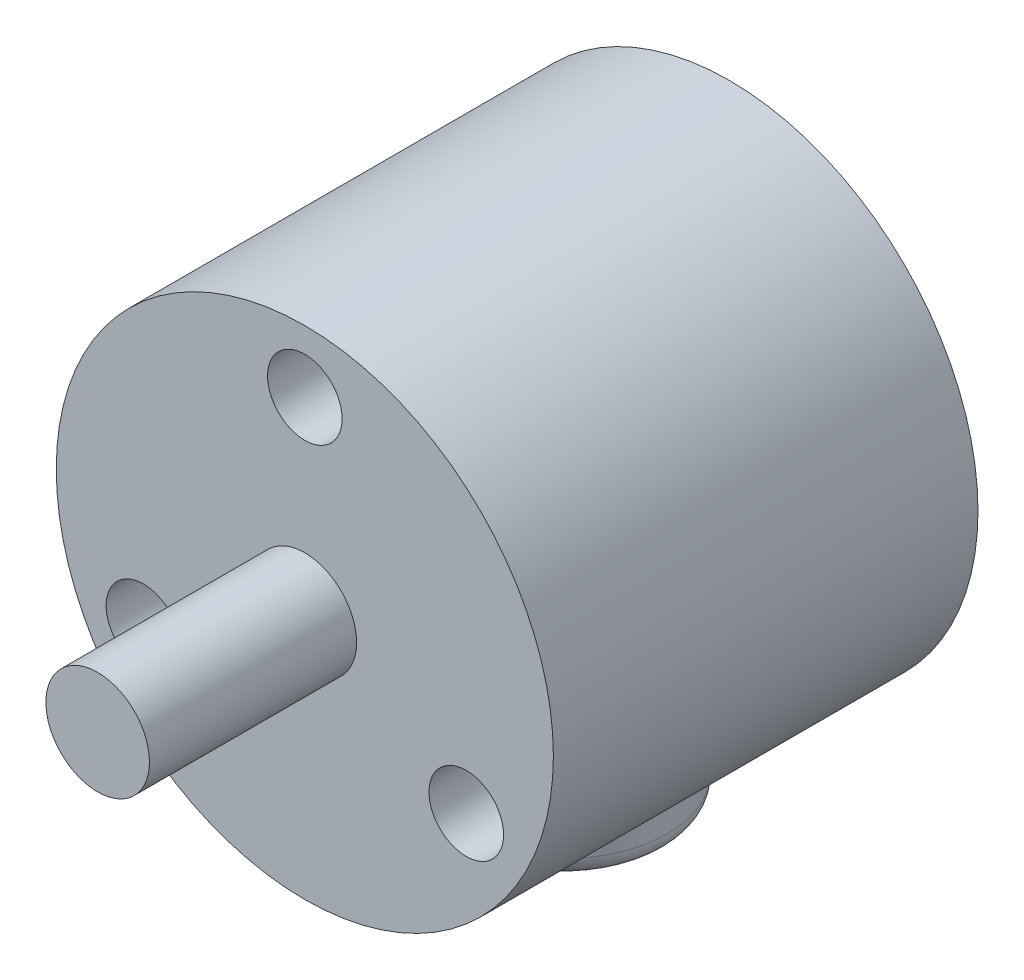
ISO-10303-21;
HEADER;
FILE_DESCRIPTION(('STEP AP214'),'2;1');
FILE_NAME('part.step','',(''),(''),'','','');
FILE_SCHEMA(('AUTOMOTIVE_DESIGN { 1 0 10303 214 1 1 1 1 }'));
ENDSEC;
DATA;
#1=APPLICATION_CONTEXT('core data for automotive mechanical design processes');
#2=APPLICATION_PROTOCOL_DEFINITION('international standard','automotive_design',2000,#1);
#3=PRODUCT_CONTEXT('',#1,'mechanical');
#4=PRODUCT('Part','Part','',(#3));
#5=PRODUCT_RELATED_PRODUCT_CATEGORY('part','',(#4));
#6=PRODUCT_DEFINITION_FORMATION('','',#4);
#7=PRODUCT_DEFINITION_CONTEXT('part definition',#1,'design');
#8=PRODUCT_DEFINITION('design','',#6,#7);
#9=PRODUCT_DEFINITION_SHAPE('','',#8);
#10=(LENGTH_UNIT() NAMED_UNIT(*) SI_UNIT(.MILLI.,.METRE.));
#11=(NAMED_UNIT(*) PLANE_ANGLE_UNIT() SI_UNIT($,.RADIAN.));
#12=(NAMED_UNIT(*) SI_UNIT($,.STERADIAN.) SOLID_ANGLE_UNIT());
#13=UNCERTAINTY_MEASURE_WITH_UNIT(LENGTH_MEASURE(1.E-05),#10,'distance_accuracy_value','');
#14=(GEOMETRIC_REPRESENTATION_CONTEXT(3) GLOBAL_UNCERTAINTY_ASSIGNED_CONTEXT((#13)) GLOBAL_UNIT_ASSIGNED_CONTEXT((#10,
#11,#12)) REPRESENTATION_CONTEXT('',''));
#15=CARTESIAN_POINT('',(0.,0.,0.));
#16=DIRECTION('',(0.,0.,1.));
#17=DIRECTION('',(1.,0.,0.));
#18=AXIS2_PLACEMENT_3D('',#15,#16,#17);
#19=CARTESIAN_POINT('',(0.,0.,20.5));
#20=DIRECTION('',(0.,0.,-1.));
#21=DIRECTION('',(-1.,0.,0.));
#22=AXIS2_PLACEMENT_3D('',#19,#20,#21);
#23=CYLINDRICAL_SURFACE('',#22,12.);
#24=CARTESIAN_POINT('',(0.,-12.,13.));
#25=CARTESIAN_POINT('',(0.133971202199808,-11.9999992729584,12.9999990914666));
#26=CARTESIAN_POINT('',(0.267987722487516,-11.9977503193947,12.9946081945841));
#27=CARTESIAN_POINT('',(0.535066499257948,-11.9888105832946,12.9730948474972));
#28=CARTESIAN_POINT('',(0.668128097998224,-11.9821169900031,12.956965606432));
#29=CARTESIAN_POINT('',(0.932528423558352,-11.9644464126044,12.9140981034186));
#30=CARTESIAN_POINT('',(1.06386304519886,-11.9534606492307,12.8873380952507));
#31=CARTESIAN_POINT('',(1.32363712069101,-11.927490817702,12.8234725282148));
#32=CARTESIAN_POINT('',(1.45207536803167,-11.9125051155232,12.7863627410574));
#33=CARTESIAN_POINT('',(1.70466599018599,-11.8789846295891,12.7023138952485));
#34=CARTESIAN_POINT('',(1.82883288573375,-11.8604636474237,12.6554129961059));
#35=CARTESIAN_POINT('',(2.07264264011727,-11.8202983493247,12.5521104896258));
#36=CARTESIAN_POINT('',(2.19228378684376,-11.7986528660016,12.4957053299424));
#37=CARTESIAN_POINT('',(2.54317702528674,-11.7298276864823,12.3129628809401));
#38=CARTESIAN_POINT('',(2.76673759984579,-11.6787121912958,12.1729849898133));
#39=CARTESIAN_POINT('',(3.19782871405717,-11.5683104696206,11.8534779348464));
#40=CARTESIAN_POINT('',(3.40415336067112,-11.5087569814803,11.672428921225));
#41=CARTESIAN_POINT('',(3.78465099990966,-11.3893017107102,11.2789084865618));
#42=CARTESIAN_POINT('',(3.95880706375339,-11.3293997617084,11.0664206260931));
#43=CARTESIAN_POINT('',(4.19642716763638,-11.2426693606487,10.722276329291));
#44=CARTESIAN_POINT('',(4.27318721758388,-11.213641472833,10.6001426427212));
#45=CARTESIAN_POINT('',(4.41607485285565,-11.158142646463,10.3492739587432));
#46=CARTESIAN_POINT('',(4.48220683770539,-11.1316706517088,10.2205417220864));
#47=CARTESIAN_POINT('',(4.60326824362323,-11.0821570819096,9.95727380138148));
#48=CARTESIAN_POINT('',(4.65819717388443,-11.0591156571702,9.82273786338529));
#49=CARTESIAN_POINT('',(4.75627631879271,-11.0172900479988,9.54886247889822));
#50=CARTESIAN_POINT('',(4.79943258893619,-10.9985036757451,9.40952554359407));
#51=CARTESIAN_POINT('',(4.87173603809854,-10.9666619504758,9.13380805072207));
#52=CARTESIAN_POINT('',(4.90145340480219,-10.9533759137281,8.99760365958737));
#53=CARTESIAN_POINT('',(4.94943501929704,-10.9317788095431,8.72286059838521));
#54=CARTESIAN_POINT('',(4.96770456006234,-10.9234654430414,8.58432303754408));
#55=CARTESIAN_POINT('',(4.9925806714702,-10.9121183161802,8.30602414623231));
#56=CARTESIAN_POINT('',(4.99919025060126,-10.9090831939376,8.16626314078902));
#57=CARTESIAN_POINT('',(5.00066965421038,-10.9084052474415,7.88666968828848));
#58=CARTESIAN_POINT('',(4.99554009665008,-10.9107621393462,7.74683724537919));
#59=CARTESIAN_POINT('',(4.97445537231527,-10.9203897344954,7.47901464805327));
#60=CARTESIAN_POINT('',(4.95936366570947,-10.9272683387031,7.35094126629261));
#61=CARTESIAN_POINT('',(4.91939456846064,-10.9453203456551,7.09659754142487));
#62=CARTESIAN_POINT('',(4.89451397815816,-10.9564951526574,6.97032780186761));
#63=CARTESIAN_POINT('',(4.83521901523602,-10.982791432776,6.72049574743192));
#64=CARTESIAN_POINT('',(4.80080681510625,-10.9979120065088,6.59693282252032));
#65=CARTESIAN_POINT('',(4.72276746407086,-11.0316484281794,6.353225711498));
#66=CARTESIAN_POINT('',(4.67913676011188,-11.0502656234987,6.23308286389346));
#67=CARTESIAN_POINT('',(4.53292198464472,-11.1114348958982,5.87391306752255));
#68=CARTESIAN_POINT('',(4.41623317355433,-11.1587355468125,5.64125821268693));
#69=CARTESIAN_POINT('',(4.14923538558579,-11.2607369782698,5.19804915238382));
#70=CARTESIAN_POINT('',(3.99891315023541,-11.315440673762,4.98750371078817));
#71=CARTESIAN_POINT('',(3.65399862437446,-11.4317164413063,4.57561717753678));
#72=CARTESIAN_POINT('',(3.4567386368719,-11.4934782659376,4.37655771261506));
#73=CARTESIAN_POINT('',(3.0308736497062,-11.6130335162842,4.01352200039607));
#74=CARTESIAN_POINT('',(2.80226132798022,-11.6708260102514,3.84955397136795));
#75=CARTESIAN_POINT('',(2.43728165238545,-11.750564458423,3.63188502116149));
#76=CARTESIAN_POINT('',(2.31032222862648,-11.7762436004382,3.56341446300228));
#77=CARTESIAN_POINT('',(2.05046026272765,-11.8242558878425,3.43749802283573));
#78=CARTESIAN_POINT('',(1.91756015985751,-11.8465903904629,3.38004766623415));
#79=CARTESIAN_POINT('',(1.64677309924856,-11.8872573475038,3.27674472498626));
#80=CARTESIAN_POINT('',(1.50888729966569,-11.9055907244947,3.23088946638133));
#81=CARTESIAN_POINT('',(1.22915368100483,-11.9377129809443,3.15125570058601));
#82=CARTESIAN_POINT('',(1.08730616375715,-11.951502205588,3.11747627606863));
#83=CARTESIAN_POINT('',(0.809887683545695,-11.9733956498248,3.06413586262167));
#84=CARTESIAN_POINT('',(0.674487262769715,-11.981804303078,3.04381063945912));
#85=CARTESIAN_POINT('',(0.402272400346696,-11.9940291261992,3.01432893966274));
#86=CARTESIAN_POINT('',(0.26545803644642,-11.9978455472339,3.00517185220077));
#87=CARTESIAN_POINT('',(-0.00847703491070739,-12.0007785959499,2.99813065484733));
#88=CARTESIAN_POINT('',(-0.145597660207647,-11.9998963609136,3.00024381705729));
#89=CARTESIAN_POINT('',(-0.419090564387011,-11.993459536273,3.01571255277727));
#90=CARTESIAN_POINT('',(-0.555462859843409,-11.9879050505733,3.02906787627665));
#91=CARTESIAN_POINT('',(-0.819630607320878,-11.9726701367381,3.06592509226874));
#92=CARTESIAN_POINT('',(-0.94751451423134,-11.9632093877852,3.08888750454916));
#93=CARTESIAN_POINT('',(-1.20082196325612,-11.940444106674,3.14460593564766));
#94=CARTESIAN_POINT('',(-1.3262446899797,-11.9271383228689,3.17736514366791));
#95=CARTESIAN_POINT('',(-1.57375204172412,-11.8970094891313,3.25236741168871));
#96=CARTESIAN_POINT('',(-1.69583759693526,-11.8801874308528,3.29460779807032));
#97=CARTESIAN_POINT('',(-1.93599084783536,-11.8434257462031,3.38821332811291));
#98=CARTESIAN_POINT('',(-2.05405699265853,-11.8234849327137,3.43958194734866));
#99=CARTESIAN_POINT('',(-2.40829498205295,-11.758346790855,3.61023048200071));
#100=CARTESIAN_POINT('',(-2.63698994915988,-11.7087843162294,3.74377555233129));
#101=CARTESIAN_POINT('',(-3.06942387949653,-11.6029475237576,4.04423069860453));
#102=CARTESIAN_POINT('',(-3.27315236592591,-11.5466704076328,4.21115470470482));
#103=CARTESIAN_POINT('',(-3.66531769677002,-11.4284863692559,4.58759654117524));
#104=CARTESIAN_POINT('',(-3.85162119447865,-11.3664645360616,4.79930583321336));
#105=CARTESIAN_POINT('',(-4.18670098676195,-11.2473669968316,5.25213329340222));
#106=CARTESIAN_POINT('',(-4.33546875898715,-11.1902924159789,5.49325812184049));
#107=CARTESIAN_POINT('',(-4.52791722204378,-11.1131825672233,5.8742799790697));
#108=CARTESIAN_POINT('',(-4.58727880369506,-11.0887445801545,6.00557844323251));
#109=CARTESIAN_POINT('',(-4.69462511155256,-11.0437261293759,6.27336529062487));
#110=CARTESIAN_POINT('',(-4.74261484462541,-11.0231439688385,6.40985135899436));
#111=CARTESIAN_POINT('',(-4.82668853878451,-10.9865909853452,6.68697231949228));
#112=CARTESIAN_POINT('',(-4.86277797828965,-10.9706180409148,6.82760526998631));
#113=CARTESIAN_POINT('',(-4.92264916938559,-10.9438843614028,7.11195411229506));
#114=CARTESIAN_POINT('',(-4.94643207850299,-10.9331231361237,7.25566971283738));
#115=CARTESIAN_POINT('',(-4.9800298567505,-10.9178575324529,7.53376050190687));
#116=CARTESIAN_POINT('',(-4.99078127149666,-10.9129342806299,7.66800030408615));
#117=CARTESIAN_POINT('',(-5.00141640257177,-10.9080644511076,7.93704951835245));
#118=CARTESIAN_POINT('',(-5.00129648146308,-10.9081195391098,8.07185910599751));
#119=CARTESIAN_POINT('',(-4.99018296923951,-10.9132080645731,8.34086161118506));
#120=CARTESIAN_POINT('',(-4.97919509044956,-10.9182388867303,8.47505481548039));
#121=CARTESIAN_POINT('',(-4.94647921783658,-10.933099505538,8.74190431694874));
#122=CARTESIAN_POINT('',(-4.92474717591724,-10.9429311109705,8.87456001553816));
#123=CARTESIAN_POINT('',(-4.87205259520336,-10.966489611938,9.13112051872267));
#124=CARTESIAN_POINT('',(-4.84157230887098,-10.9800115342469,9.25514344248263));
#125=CARTESIAN_POINT('',(-4.77136925956337,-11.0106991045504,9.50009782053465));
#126=CARTESIAN_POINT('',(-4.73164330745016,-11.0278660096413,9.62102819209136));
#127=CARTESIAN_POINT('',(-4.59908761582496,-11.0841175717513,9.97806154942845));
#128=CARTESIAN_POINT('',(-4.49284253561317,-11.1279707524951,10.2085872556077));
#129=CARTESIAN_POINT('',(-4.24040889849447,-11.226679213664,10.6628156060107));
#130=CARTESIAN_POINT('',(-4.09220273518373,-11.2820374827937,10.8852745547109));
#131=CARTESIAN_POINT('',(-3.76270798192949,-11.396154190208,11.3034553285329));
#132=CARTESIAN_POINT('',(-3.58140792090314,-11.4549138026364,11.499167841482));
#133=CARTESIAN_POINT('',(-3.28060198965565,-11.5433831914863,11.7759891123433));
#134=CARTESIAN_POINT('',(-3.17135125699736,-11.5739466268846,11.8682042514757));
#135=CARTESIAN_POINT('',(-2.94510913832992,-11.6335718153871,12.0431112048865));
#136=CARTESIAN_POINT('',(-2.82812052219569,-11.6626340992841,12.1258063982126));
#137=CARTESIAN_POINT('',(-2.58697642479179,-11.7184848881627,12.281138652427));
#138=CARTESIAN_POINT('',(-2.46281438535245,-11.7452712553474,12.3537662962983));
#139=CARTESIAN_POINT('',(-2.2082535237545,-11.7957806454889,12.4882427852065));
#140=CARTESIAN_POINT('',(-2.07785761247781,-11.8195050794223,12.5500965995833));
#141=CARTESIAN_POINT('',(-1.81380017769054,-11.8628724264483,12.6615810427001));
#142=CARTESIAN_POINT('',(-1.68022444756869,-11.8825746428453,12.7113916311525));
#143=CARTESIAN_POINT('',(-1.40886045780292,-11.9177941454219,12.7995260141615));
#144=CARTESIAN_POINT('',(-1.27107423050946,-11.9333134162086,12.8378552570307));
#145=CARTESIAN_POINT('',(-0.992651980203959,-11.959688566513,12.9025525244881));
#146=CARTESIAN_POINT('',(-0.852023905428952,-11.9705559590045,12.9289500880649));
#147=CARTESIAN_POINT('',(-0.56880246605397,-11.9873498855457,12.9695979090313));
#148=CARTESIAN_POINT('',(-0.426210622389143,-11.9932800463356,12.9838570830855));
#149=CARTESIAN_POINT('',(-0.236110915428313,-11.9977699594236,12.9946457709799));
#150=CARTESIAN_POINT('',(-0.188916808355246,-11.9986057728967,12.9966530624495));
#151=CARTESIAN_POINT('',(-0.0944836795338208,-11.9997209221766,12.9993303390705));
#152=CARTESIAN_POINT('',(-0.0472446576572318,-12.0000002563897,13.0000003203924));
#153=CARTESIAN_POINT('',(0.,-12.,13.));
#154=B_SPLINE_CURVE_WITH_KNOTS('',3,(#24,#25,#26,#27,#28,#29,#30,#31,#32,#33,#34,#35,#36,#37,
#38,#39,#40,#41,#42,#43,#44,#45,#46,#47,#48,#49,#50,#51,#52,#53,#54,#55,#56,#57,#58,#59,#60,#61,
#62,#63,#64,#65,#66,#67,#68,#69,#70,#71,#72,#73,#74,#75,#76,#77,#78,#79,#80,#81,#82,#83,#84,#85,
#86,#87,#88,#89,#90,#91,#92,#93,#94,#95,#96,#97,#98,#99,#100,#101,#102,#103,#104,#105,#106,#107,
#108,#109,#110,#111,#112,#113,#114,#115,#116,#117,#118,#119,#120,#121,#122,#123,#124,#125,#126,
#127,#128,#129,#130,#131,#132,#133,#134,#135,#136,#137,#138,#139,#140,#141,#142,#143,#144,#145,
#146,#147,#148,#149,#150,#151,#152,#153),.UNSPECIFIED.,.T.,.F.,(4,2,2,2,2,2,2,2,2,2,2,2,2,2,2,2,
2,2,2,2,2,2,2,2,2,2,2,2,2,2,2,2,2,2,2,2,2,2,2,2,2,2,2,2,2,2,2,2,2,2,2,2,2,2,2,2,2,2,2,2,2,2,2,2,
4),(0.,0.401865511192765,0.803985401292742,1.20693213583696,1.61004373163513,2.01161264408377,
2.41333198262602,3.21570232241271,4.05488202655309,4.89450210025943,5.33547541815659,
5.77626572075065,6.21707533026384,6.657657771416,7.07721787938552,7.49658385769289,
7.91584161588806,8.33507730438084,8.72205078978925,9.10915086914489,9.49616279130698,
9.88332415102038,10.6733254842805,11.4636387906201,12.3207426070477,13.1780469345154,
13.6171124056289,14.0559992214016,14.4947847324951,14.9335369046603,15.3445355807386,
15.755511776716,16.1663885028034,16.5772560917832,16.9676245545711,17.3581202346347,
17.7485059359724,18.1390405964013,18.9435709432164,19.7484377511098,20.6108250535017,
21.4734079819436,21.911378276108,22.3491553782635,22.7867306630771,23.2242647829867,
23.6280231699892,24.0319166509118,24.435597953478,24.8394314677677,25.2242700123875,
25.6092414978881,26.3786352973221,27.1942912351952,28.0102304363353,28.4483841335548,
28.8863818280895,29.3247864929416,29.7629884086909,30.1941695396216,30.6251457342279,
31.0550490470869,31.4846362867339,31.6263528931453,31.7680699053748),.UNSPECIFIED.);
#155=CARTESIAN_POINT('',(0.,-12.,13.));
#156=VERTEX_POINT('',#155);
#157=EDGE_CURVE('E54',#156,#156,#154,.T.);
#158=ORIENTED_EDGE('',*,*,#157,.T.);
#159=EDGE_LOOP('',(#158));
#160=FACE_BOUND('',#159,.T.);
#161=CARTESIAN_POINT('',(0.,0.,20.5));
#162=DIRECTION('',(0.,0.,1.));
#163=DIRECTION('',(1.,0.,0.));
#164=AXIS2_PLACEMENT_3D('',#161,#162,#163);
#165=CIRCLE('',#164,12.);
#166=CARTESIAN_POINT('',(12.,0.,20.5));
#167=VERTEX_POINT('',#166);
#168=EDGE_CURVE('E51',#167,#167,#165,.T.);
#169=ORIENTED_EDGE('',*,*,#168,.F.);
#170=EDGE_LOOP('',(#169));
#171=FACE_BOUND('',#170,.T.);
#172=CARTESIAN_POINT('',(0.,0.,0.));
#173=DIRECTION('',(0.,0.,1.));
#174=DIRECTION('',(1.,0.,0.));
#175=AXIS2_PLACEMENT_3D('',#172,#173,#174);
#176=CIRCLE('',#175,12.);
#177=CARTESIAN_POINT('',(12.,0.,0.));
#178=VERTEX_POINT('',#177);
#179=EDGE_CURVE('E62',#178,#178,#176,.T.);
#180=ORIENTED_EDGE('',*,*,#179,.T.);
#181=EDGE_LOOP('',(#180));
#182=FACE_BOUND('',#181,.T.);
#183=ADVANCED_FACE('F36',(#160,#171,#182),#23,.T.);
#184=CARTESIAN_POINT('',(0.,0.,20.5));
#185=DIRECTION('',(0.,0.,1.));
#186=DIRECTION('',(1.,0.,0.));
#187=AXIS2_PLACEMENT_3D('',#184,#185,#186);
#188=PLANE('',#187);
#189=CARTESIAN_POINT('',(-7.79422863405991,-4.50000000000006,20.5));
#190=DIRECTION('',(0.,0.,1.));
#191=DIRECTION('',(1.,0.,0.));
#192=AXIS2_PLACEMENT_3D('',#189,#190,#191);
#193=CIRCLE('',#192,1.8);
#194=CARTESIAN_POINT('',(-5.99422863405991,-4.50000000000006,20.5));
#195=VERTEX_POINT('',#194);
#196=EDGE_CURVE('E125',#195,#195,#193,.T.);
#197=ORIENTED_EDGE('',*,*,#196,.F.);
#198=EDGE_LOOP('',(#197));
#199=FACE_BOUND('',#198,.T.);
#200=CARTESIAN_POINT('',(7.79422863405994,-4.50000000000001,20.5));
#201=DIRECTION('',(0.,0.,1.));
#202=DIRECTION('',(1.,0.,0.));
#203=AXIS2_PLACEMENT_3D('',#200,#201,#202);
#204=CIRCLE('',#203,1.8);
#205=CARTESIAN_POINT('',(9.59422863405994,-4.50000000000001,20.5));
#206=VERTEX_POINT('',#205);
#207=EDGE_CURVE('E135',#206,#206,#204,.T.);
#208=ORIENTED_EDGE('',*,*,#207,.F.);
#209=EDGE_LOOP('',(#208));
#210=FACE_BOUND('',#209,.T.);
#211=CARTESIAN_POINT('',(0.,9.,20.5));
#212=DIRECTION('',(0.,0.,1.));
#213=DIRECTION('',(1.,0.,0.));
#214=AXIS2_PLACEMENT_3D('',#211,#212,#213);
#215=CIRCLE('',#214,1.8);
#216=CARTESIAN_POINT('',(1.8,9.,20.5));
#217=VERTEX_POINT('',#216);
#218=EDGE_CURVE('E141',#217,#217,#215,.T.);
#219=ORIENTED_EDGE('',*,*,#218,.F.);
#220=EDGE_LOOP('',(#219));
#221=FACE_BOUND('',#220,.T.);
#222=CARTESIAN_POINT('',(0.,0.,20.5));
#223=DIRECTION('',(0.,0.,1.));
#224=DIRECTION('',(1.,0.,0.));
#225=AXIS2_PLACEMENT_3D('',#222,#223,#224);
#226=CIRCLE('',#225,2.5);
#227=CARTESIAN_POINT('',(2.5,0.,20.5));
#228=VERTEX_POINT('',#227);
#229=EDGE_CURVE('E47',#228,#228,#226,.T.);
#230=ORIENTED_EDGE('',*,*,#229,.F.);
#231=EDGE_LOOP('',(#230));
#232=FACE_BOUND('',#231,.T.);
#233=ORIENTED_EDGE('',*,*,#168,.T.);
#234=EDGE_LOOP('',(#233));
#235=FACE_BOUND('',#234,.T.);
#236=ADVANCED_FACE('F105',(#199,#210,#221,#232,#235),#188,.T.);
#237=CARTESIAN_POINT('',(0.,0.,0.));
#238=DIRECTION('',(0.,0.,1.));
#239=DIRECTION('',(1.,0.,0.));
#240=AXIS2_PLACEMENT_3D('',#237,#238,#239);
#241=PLANE('',#240);
#242=ORIENTED_EDGE('',*,*,#179,.F.);
#243=EDGE_LOOP('',(#242));
#244=FACE_BOUND('',#243,.T.);
#245=ADVANCED_FACE('F103',(#244),#241,.F.);
#246=CARTESIAN_POINT('',(0.,0.,24.));
#247=DIRECTION('',(0.,0.,-1.));
#248=DIRECTION('',(-1.,0.,0.));
#249=AXIS2_PLACEMENT_3D('',#246,#247,#248);
#250=CYLINDRICAL_SURFACE('',#249,2.5);
#251=ORIENTED_EDGE('',*,*,#229,.T.);
#252=EDGE_LOOP('',(#251));
#253=FACE_BOUND('',#252,.T.);
#254=CARTESIAN_POINT('',(0.,0.,30.5));
#255=DIRECTION('',(0.,0.,1.));
#256=DIRECTION('',(1.,0.,0.));
#257=AXIS2_PLACEMENT_3D('',#254,#255,#256);
#258=CIRCLE('',#257,2.5);
#259=CARTESIAN_POINT('',(2.5,0.,30.5));
#260=VERTEX_POINT('',#259);
#261=EDGE_CURVE('E61',#260,#260,#258,.T.);
#262=ORIENTED_EDGE('',*,*,#261,.F.);
#263=EDGE_LOOP('',(#262));
#264=FACE_BOUND('',#263,.T.);
#265=ADVANCED_FACE('F99',(#253,#264),#250,.T.);
#266=CARTESIAN_POINT('',(0.,9.,17.5));
#267=DIRECTION('',(0.,0.,1.));
#268=DIRECTION('',(1.,0.,0.));
#269=AXIS2_PLACEMENT_3D('',#266,#267,#268);
#270=CYLINDRICAL_SURFACE('',#269,1.8);
#271=CARTESIAN_POINT('',(0.,9.,17.5));
#272=DIRECTION('',(0.,0.,1.));
#273=DIRECTION('',(1.,0.,0.));
#274=AXIS2_PLACEMENT_3D('',#271,#272,#273);
#275=CIRCLE('',#274,1.8);
#276=CARTESIAN_POINT('',(1.8,9.,17.5));
#277=VERTEX_POINT('',#276);
#278=EDGE_CURVE('E138',#277,#277,#275,.T.);
#279=ORIENTED_EDGE('',*,*,#278,.F.);
#280=EDGE_LOOP('',(#279));
#281=FACE_BOUND('',#280,.T.);
#282=ORIENTED_EDGE('',*,*,#218,.T.);
#283=EDGE_LOOP('',(#282));
#284=FACE_BOUND('',#283,.T.);
#285=ADVANCED_FACE('F95',(#281,#284),#270,.F.);
#286=CARTESIAN_POINT('',(0.,0.,17.5));
#287=DIRECTION('',(0.,0.,1.));
#288=DIRECTION('',(1.,0.,0.));
#289=AXIS2_PLACEMENT_3D('',#286,#287,#288);
#290=PLANE('',#289);
#291=ORIENTED_EDGE('',*,*,#278,.T.);
#292=EDGE_LOOP('',(#291));
#293=FACE_BOUND('',#292,.T.);
#294=ADVANCED_FACE('F91',(#293),#290,.T.);
#295=CARTESIAN_POINT('',(7.79422863405994,-4.50000000000001,17.5));
#296=DIRECTION('',(0.,0.,1.));
#297=DIRECTION('',(1.,0.,0.));
#298=AXIS2_PLACEMENT_3D('',#295,#296,#297);
#299=CYLINDRICAL_SURFACE('',#298,1.8);
#300=CARTESIAN_POINT('',(7.79422863405994,-4.50000000000001,17.5));
#301=DIRECTION('',(0.,0.,1.));
#302=DIRECTION('',(1.,0.,0.));
#303=AXIS2_PLACEMENT_3D('',#300,#301,#302);
#304=CIRCLE('',#303,1.8);
#305=CARTESIAN_POINT('',(9.59422863405994,-4.50000000000001,17.5));
#306=VERTEX_POINT('',#305);
#307=EDGE_CURVE('E129',#306,#306,#304,.T.);
#308=ORIENTED_EDGE('',*,*,#307,.F.);
#309=EDGE_LOOP('',(#308));
#310=FACE_BOUND('',#309,.T.);
#311=ORIENTED_EDGE('',*,*,#207,.T.);
#312=EDGE_LOOP('',(#311));
#313=FACE_BOUND('',#312,.T.);
#314=ADVANCED_FACE('F87',(#310,#313),#299,.F.);
#315=CARTESIAN_POINT('',(0.,0.,17.5));
#316=DIRECTION('',(0.,0.,1.));
#317=DIRECTION('',(1.,0.,0.));
#318=AXIS2_PLACEMENT_3D('',#315,#316,#317);
#319=PLANE('',#318);
#320=ORIENTED_EDGE('',*,*,#307,.T.);
#321=EDGE_LOOP('',(#320));
#322=FACE_BOUND('',#321,.T.);
#323=ADVANCED_FACE('F83',(#322),#319,.T.);
#324=CARTESIAN_POINT('',(-7.79422863405991,-4.50000000000006,17.5));
#325=DIRECTION('',(0.,0.,1.));
#326=DIRECTION('',(1.,0.,0.));
#327=AXIS2_PLACEMENT_3D('',#324,#325,#326);
#328=CYLINDRICAL_SURFACE('',#327,1.8);
#329=CARTESIAN_POINT('',(-7.79422863405991,-4.50000000000006,17.5));
#330=DIRECTION('',(0.,0.,1.));
#331=DIRECTION('',(1.,0.,0.));
#332=AXIS2_PLACEMENT_3D('',#329,#330,#331);
#333=CIRCLE('',#332,1.8);
#334=CARTESIAN_POINT('',(-5.99422863405991,-4.50000000000006,17.5));
#335=VERTEX_POINT('',#334);
#336=EDGE_CURVE('E123',#335,#335,#333,.T.);
#337=ORIENTED_EDGE('',*,*,#336,.F.);
#338=EDGE_LOOP('',(#337));
#339=FACE_BOUND('',#338,.T.);
#340=ORIENTED_EDGE('',*,*,#196,.T.);
#341=EDGE_LOOP('',(#340));
#342=FACE_BOUND('',#341,.T.);
#343=ADVANCED_FACE('F79',(#339,#342),#328,.F.);
#344=CARTESIAN_POINT('',(0.,0.,17.5));
#345=DIRECTION('',(0.,0.,1.));
#346=DIRECTION('',(1.,0.,0.));
#347=AXIS2_PLACEMENT_3D('',#344,#345,#346);
#348=PLANE('',#347);
#349=ORIENTED_EDGE('',*,*,#336,.T.);
#350=EDGE_LOOP('',(#349));
#351=FACE_BOUND('',#350,.T.);
#352=ADVANCED_FACE('F75',(#351),#348,.T.);
#353=CARTESIAN_POINT('',(0.,0.,30.5));
#354=DIRECTION('',(0.,0.,1.));
#355=DIRECTION('',(1.,0.,0.));
#356=AXIS2_PLACEMENT_3D('',#353,#354,#355);
#357=PLANE('',#356);
#358=ORIENTED_EDGE('',*,*,#261,.T.);
#359=EDGE_LOOP('',(#358));
#360=FACE_BOUND('',#359,.T.);
#361=ADVANCED_FACE('F72',(#360),#357,.T.);
#362=CARTESIAN_POINT('',(0.,-14.,8.));
#363=DIRECTION('',(0.,1.,0.));
#364=DIRECTION('',(0.,0.,1.));
#365=AXIS2_PLACEMENT_3D('',#362,#363,#364);
#366=CYLINDRICAL_SURFACE('',#365,5.);
#367=CARTESIAN_POINT('',(0.,-13.,8.));
#368=DIRECTION('',(0.,1.,0.));
#369=DIRECTION('',(0.,0.,1.));
#370=AXIS2_PLACEMENT_3D('',#367,#368,#369);
#371=CIRCLE('',#370,5.);
#372=CARTESIAN_POINT('',(0.,-13.,13.));
#373=VERTEX_POINT('',#372);
#374=EDGE_CURVE('E43',#373,#373,#371,.T.);
#375=ORIENTED_EDGE('',*,*,#374,.T.);
#376=EDGE_LOOP('',(#375));
#377=FACE_BOUND('',#376,.T.);
#378=ORIENTED_EDGE('',*,*,#157,.F.);
#379=EDGE_LOOP('',(#378));
#380=FACE_BOUND('',#379,.T.);
#381=ADVANCED_FACE('F66',(#377,#380),#366,.T.);
#382=CARTESIAN_POINT('',(0.,-14.,8.));
#383=DIRECTION('',(0.,1.,0.));
#384=DIRECTION('',(0.,0.,1.));
#385=AXIS2_PLACEMENT_3D('',#382,#383,#384);
#386=PLANE('',#385);
#387=CARTESIAN_POINT('',(0.,-14.,8.));
#388=DIRECTION('',(0.,1.,0.));
#389=DIRECTION('',(0.,0.,1.));
#390=AXIS2_PLACEMENT_3D('',#387,#388,#389);
#391=CIRCLE('',#390,4.);
#392=CARTESIAN_POINT('',(0.,-14.,12.));
#393=VERTEX_POINT('',#392);
#394=EDGE_CURVE('E10',#393,#393,#391,.F.);
#395=ORIENTED_EDGE('',*,*,#394,.T.);
#396=EDGE_LOOP('',(#395));
#397=FACE_BOUND('',#396,.T.);
#398=ADVANCED_FACE('F71',(#397),#386,.F.);
#399=CARTESIAN_POINT('',(0.,-13.,8.));
#400=DIRECTION('',(0.,1.,0.));
#401=DIRECTION('',(0.,0.,1.));
#402=AXIS2_PLACEMENT_3D('',#399,#400,#401);
#403=TOROIDAL_SURFACE('',#402,4.,1.);
#404=ORIENTED_EDGE('',*,*,#394,.F.);
#405=EDGE_LOOP('',(#404));
#406=FACE_BOUND('',#405,.T.);
#407=ORIENTED_EDGE('',*,*,#374,.F.);
#408=EDGE_LOOP('',(#407));
#409=FACE_BOUND('',#408,.T.);
#410=ADVANCED_FACE('F38',(#406,#409),#403,.T.);
#411=CLOSED_SHELL('',(#183,#236,#245,#265,#285,#294,#314,#323,#343,#352,#361,#381,#398,#410));
#412=MANIFOLD_SOLID_BREP('B2',#411);
#413=ADVANCED_BREP_SHAPE_REPRESENTATION('',(#18,#412),#14);
#414=SHAPE_DEFINITION_REPRESENTATION(#9,#413);
ENDSEC;
END-ISO-10303-21;
